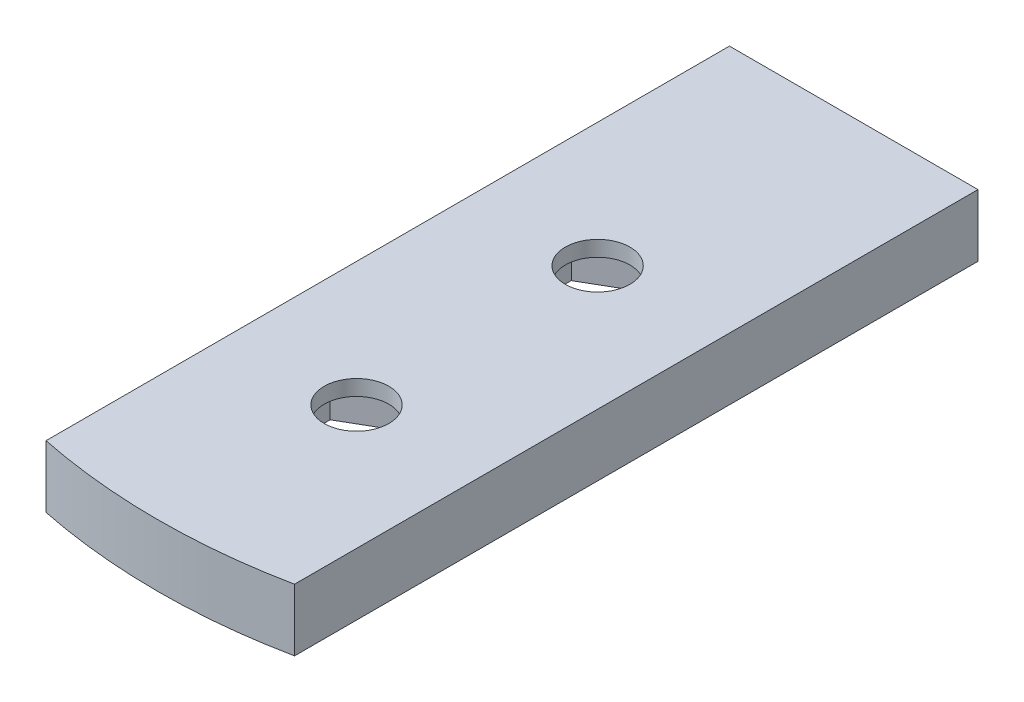
ISO-10303-21;
HEADER;
FILE_DESCRIPTION(('STEP AP214'),'2;1');
FILE_NAME('part.step','',(''),(''),'','','');
FILE_SCHEMA(('AUTOMOTIVE_DESIGN { 1 0 10303 214 1 1 1 1 }'));
ENDSEC;
DATA;
#1=APPLICATION_CONTEXT('core data for automotive mechanical design processes');
#2=APPLICATION_PROTOCOL_DEFINITION('international standard','automotive_design',2000,#1);
#3=PRODUCT_CONTEXT('',#1,'mechanical');
#4=PRODUCT('Part','Part','',(#3));
#5=PRODUCT_RELATED_PRODUCT_CATEGORY('part','',(#4));
#6=PRODUCT_DEFINITION_FORMATION('','',#4);
#7=PRODUCT_DEFINITION_CONTEXT('part definition',#1,'design');
#8=PRODUCT_DEFINITION('design','',#6,#7);
#9=PRODUCT_DEFINITION_SHAPE('','',#8);
#10=(LENGTH_UNIT() NAMED_UNIT(*) SI_UNIT(.MILLI.,.METRE.));
#11=(NAMED_UNIT(*) PLANE_ANGLE_UNIT() SI_UNIT($,.RADIAN.));
#12=(NAMED_UNIT(*) SI_UNIT($,.STERADIAN.) SOLID_ANGLE_UNIT());
#13=UNCERTAINTY_MEASURE_WITH_UNIT(LENGTH_MEASURE(1.E-05),#10,'distance_accuracy_value','');
#14=(GEOMETRIC_REPRESENTATION_CONTEXT(3) GLOBAL_UNCERTAINTY_ASSIGNED_CONTEXT((#13)) GLOBAL_UNIT_ASSIGNED_CONTEXT((#10,
#11,#12)) REPRESENTATION_CONTEXT('',''));
#15=CARTESIAN_POINT('',(0.,0.,0.));
#16=DIRECTION('',(0.,0.,1.));
#17=DIRECTION('',(1.,0.,0.));
#18=AXIS2_PLACEMENT_3D('',#15,#16,#17);
#19=CARTESIAN_POINT('',(-0.00583710172408214,0.,13.9437641846587));
#20=DIRECTION('',(0.,1.,0.));
#21=DIRECTION('',(0.,0.,1.));
#22=AXIS2_PLACEMENT_3D('',#19,#20,#21);
#23=PLANE('',#22);
#24=DIRECTION('',(0.866025403784438,0.,-0.5));
#25=VECTOR('',#24,1.);
#26=CARTESIAN_POINT('',(-0.00583710172408144,0.,26.8956030908503));
#27=LINE('',#26,#25);
#28=CARTESIAN_POINT('',(-0.00583710172408127,0.,26.8956030908503));
#29=VERTEX_POINT('',#28);
#30=CARTESIAN_POINT('',(3.18186289827592,0.,25.0551836377545));
#31=VERTEX_POINT('',#30);
#32=EDGE_CURVE('E56',#29,#31,#27,.T.);
#33=ORIENTED_EDGE('',*,*,#32,.T.);
#34=DIRECTION('',(0.,0.,-1.));
#35=VECTOR('',#34,1.);
#36=CARTESIAN_POINT('',(3.18186289827592,0.,25.0551836377545));
#37=LINE('',#36,#35);
#38=CARTESIAN_POINT('',(3.18186289827592,0.,21.3743447315629));
#39=VERTEX_POINT('',#38);
#40=EDGE_CURVE('E248',#31,#39,#37,.T.);
#41=ORIENTED_EDGE('',*,*,#40,.T.);
#42=DIRECTION('',(-0.866025403784438,0.,-0.500000000000001));
#43=VECTOR('',#42,1.);
#44=CARTESIAN_POINT('',(3.18186289827592,0.,21.3743447315629));
#45=LINE('',#44,#43);
#46=CARTESIAN_POINT('',(-0.00583710172407792,0.,19.5339252784672));
#47=VERTEX_POINT('',#46);
#48=EDGE_CURVE('E251',#39,#47,#45,.T.);
#49=ORIENTED_EDGE('',*,*,#48,.T.);
#50=DIRECTION('',(-0.866025403784438,0.,0.5));
#51=VECTOR('',#50,1.);
#52=CARTESIAN_POINT('',(-0.00583710172407792,0.,19.5339252784672));
#53=LINE('',#52,#51);
#54=CARTESIAN_POINT('',(-3.19353710172408,0.,21.3743447315629));
#55=VERTEX_POINT('',#54);
#56=EDGE_CURVE('E254',#47,#55,#53,.T.);
#57=ORIENTED_EDGE('',*,*,#56,.T.);
#58=DIRECTION('',(0.,0.,1.));
#59=VECTOR('',#58,1.);
#60=CARTESIAN_POINT('',(-3.19353710172408,0.,21.3743447315629));
#61=LINE('',#60,#59);
#62=CARTESIAN_POINT('',(-3.19353710172408,0.,25.0551836377545));
#63=VERTEX_POINT('',#62);
#64=EDGE_CURVE('E257',#55,#63,#61,.T.);
#65=ORIENTED_EDGE('',*,*,#64,.T.);
#66=DIRECTION('',(0.866025403784438,0.,0.5));
#67=VECTOR('',#66,1.);
#68=CARTESIAN_POINT('',(-3.19353710172408,0.,25.0551836377545));
#69=LINE('',#68,#67);
#70=EDGE_CURVE('E231',#63,#29,#69,.T.);
#71=ORIENTED_EDGE('',*,*,#70,.T.);
#72=EDGE_LOOP('',(#33,#41,#49,#57,#65,#71));
#73=FACE_BOUND('',#72,.T.);
#74=DIRECTION('',(0.,0.,1.));
#75=VECTOR('',#74,1.);
#76=CARTESIAN_POINT('',(-6.35583710172408,0.,10.1272839180051));
#77=LINE('',#76,#75);
#78=CARTESIAN_POINT('',(-6.35583710172408,0.,10.1272839180051));
#79=VERTEX_POINT('',#78);
#80=CARTESIAN_POINT('',(-6.35583710172409,0.,45.0522839180051));
#81=VERTEX_POINT('',#80);
#82=EDGE_CURVE('E273',#79,#81,#77,.T.);
#83=ORIENTED_EDGE('',*,*,#82,.F.);
#84=DIRECTION('',(-1.,0.,0.));
#85=VECTOR('',#84,1.);
#86=CARTESIAN_POINT('',(-6.35583710172408,0.,10.1272839180051));
#87=LINE('',#86,#85);
#88=CARTESIAN_POINT('',(6.34416289827592,0.,10.1272839180051));
#89=VERTEX_POINT('',#88);
#90=EDGE_CURVE('E279',#89,#79,#87,.T.);
#91=ORIENTED_EDGE('',*,*,#90,.F.);
#92=DIRECTION('',(0.,0.,-1.));
#93=VECTOR('',#92,1.);
#94=CARTESIAN_POINT('',(6.34416289827592,0.,10.1272839180051));
#95=LINE('',#94,#93);
#96=CARTESIAN_POINT('',(6.34416289827592,0.,45.0522839180051));
#97=VERTEX_POINT('',#96);
#98=EDGE_CURVE('E277',#97,#89,#95,.T.);
#99=ORIENTED_EDGE('',*,*,#98,.F.);
#100=CARTESIAN_POINT('',(-0.00583710172408214,0.,13.9437641846587));
#101=DIRECTION('',(0.,1.,0.));
#102=DIRECTION('',(0.,0.,1.));
#103=AXIS2_PLACEMENT_3D('',#100,#101,#102);
#104=CIRCLE('',#103,31.75);
#105=EDGE_CURVE('E154',#81,#97,#104,.T.);
#106=ORIENTED_EDGE('',*,*,#105,.F.);
#107=EDGE_LOOP('',(#83,#91,#99,#106));
#108=FACE_BOUND('',#107,.T.);
#109=DIRECTION('',(0.866025403784439,0.,-0.499999999999999));
#110=VECTOR('',#109,1.);
#111=CARTESIAN_POINT('',(-0.00583710172407687,0.,39.2146030908503));
#112=LINE('',#111,#110);
#113=CARTESIAN_POINT('',(-0.00583710172407693,0.,39.2146030908503));
#114=VERTEX_POINT('',#113);
#115=CARTESIAN_POINT('',(3.18186289827592,0.,37.3741836377545));
#116=VERTEX_POINT('',#115);
#117=EDGE_CURVE('E48',#114,#116,#112,.T.);
#118=ORIENTED_EDGE('',*,*,#117,.T.);
#119=DIRECTION('',(0.,0.,-1.));
#120=VECTOR('',#119,1.);
#121=CARTESIAN_POINT('',(3.18186289827592,0.,37.3741836377545));
#122=LINE('',#121,#120);
#123=CARTESIAN_POINT('',(3.18186289827592,0.,33.6933447315629));
#124=VERTEX_POINT('',#123);
#125=EDGE_CURVE('E202',#116,#124,#122,.T.);
#126=ORIENTED_EDGE('',*,*,#125,.T.);
#127=DIRECTION('',(-0.866025403784439,0.,-0.5));
#128=VECTOR('',#127,1.);
#129=CARTESIAN_POINT('',(3.18186289827592,0.,33.6933447315629));
#130=LINE('',#129,#128);
#131=CARTESIAN_POINT('',(-0.00583710172408358,0.,31.8529252784672));
#132=VERTEX_POINT('',#131);
#133=EDGE_CURVE('E205',#124,#132,#130,.T.);
#134=ORIENTED_EDGE('',*,*,#133,.T.);
#135=DIRECTION('',(-0.866025403784439,0.,0.499999999999999));
#136=VECTOR('',#135,1.);
#137=CARTESIAN_POINT('',(-0.00583710172408358,0.,31.8529252784672));
#138=LINE('',#137,#136);
#139=CARTESIAN_POINT('',(-3.19353710172409,0.,33.6933447315629));
#140=VERTEX_POINT('',#139);
#141=EDGE_CURVE('E208',#132,#140,#138,.T.);
#142=ORIENTED_EDGE('',*,*,#141,.T.);
#143=DIRECTION('',(0.,0.,1.));
#144=VECTOR('',#143,1.);
#145=CARTESIAN_POINT('',(-3.19353710172409,0.,33.6933447315629));
#146=LINE('',#145,#144);
#147=CARTESIAN_POINT('',(-3.19353710172409,0.,37.3741836377545));
#148=VERTEX_POINT('',#147);
#149=EDGE_CURVE('E211',#140,#148,#146,.T.);
#150=ORIENTED_EDGE('',*,*,#149,.T.);
#151=DIRECTION('',(0.866025403784439,0.,0.499999999999999));
#152=VECTOR('',#151,1.);
#153=CARTESIAN_POINT('',(-3.19353710172409,0.,37.3741836377545));
#154=LINE('',#153,#152);
#155=EDGE_CURVE('E185',#148,#114,#154,.T.);
#156=ORIENTED_EDGE('',*,*,#155,.T.);
#157=EDGE_LOOP('',(#118,#126,#134,#142,#150,#156));
#158=FACE_BOUND('',#157,.T.);
#159=ADVANCED_FACE('F33',(#73,#108,#158),#23,.F.);
#160=CARTESIAN_POINT('',(-6.35583710172408,2.38125,10.1272839180051));
#161=DIRECTION('',(1.,0.,0.));
#162=DIRECTION('',(0.,0.,-1.));
#163=AXIS2_PLACEMENT_3D('',#160,#161,#162);
#164=PLANE('',#163);
#165=ORIENTED_EDGE('',*,*,#82,.T.);
#166=DIRECTION('',(0.,-1.,0.));
#167=VECTOR('',#166,1.);
#168=CARTESIAN_POINT('',(-6.35583710172409,2.38125,45.0522839180051));
#169=LINE('',#168,#167);
#170=CARTESIAN_POINT('',(-6.35583710172409,3.175,45.0522839180051));
#171=VERTEX_POINT('',#170);
#172=EDGE_CURVE('E11',#171,#81,#169,.T.);
#173=ORIENTED_EDGE('',*,*,#172,.F.);
#174=DIRECTION('',(0.,0.,1.));
#175=VECTOR('',#174,1.);
#176=CARTESIAN_POINT('',(-6.35583710172408,3.175,10.1272839180051));
#177=LINE('',#176,#175);
#178=CARTESIAN_POINT('',(-6.35583710172408,3.175,10.1272839180051));
#179=VERTEX_POINT('',#178);
#180=EDGE_CURVE('E171',#179,#171,#177,.T.);
#181=ORIENTED_EDGE('',*,*,#180,.F.);
#182=DIRECTION('',(0.,-1.,0.));
#183=VECTOR('',#182,1.);
#184=CARTESIAN_POINT('',(-6.35583710172408,2.38125,10.1272839180051));
#185=LINE('',#184,#183);
#186=EDGE_CURVE('E281',#179,#79,#185,.T.);
#187=ORIENTED_EDGE('',*,*,#186,.T.);
#188=EDGE_LOOP('',(#165,#173,#181,#187));
#189=FACE_BOUND('',#188,.T.);
#190=ADVANCED_FACE('F35',(#189),#164,.F.);
#191=CARTESIAN_POINT('',(-0.00583710172408214,2.38125,13.9437641846587));
#192=DIRECTION('',(0.,-1.,0.));
#193=DIRECTION('',(0.,0.,-1.));
#194=AXIS2_PLACEMENT_3D('',#191,#192,#193);
#195=CYLINDRICAL_SURFACE('',#194,31.75);
#196=ORIENTED_EDGE('',*,*,#105,.T.);
#197=DIRECTION('',(0.,-1.,0.));
#198=VECTOR('',#197,1.);
#199=CARTESIAN_POINT('',(6.34416289827592,2.38125,45.0522839180051));
#200=LINE('',#199,#198);
#201=CARTESIAN_POINT('',(6.34416289827592,3.175,45.0522839180051));
#202=VERTEX_POINT('',#201);
#203=EDGE_CURVE('E41',#202,#97,#200,.T.);
#204=ORIENTED_EDGE('',*,*,#203,.F.);
#205=CARTESIAN_POINT('',(-0.00583710172408214,3.175,13.9437641846587));
#206=DIRECTION('',(0.,1.,0.));
#207=DIRECTION('',(0.,0.,1.));
#208=AXIS2_PLACEMENT_3D('',#205,#206,#207);
#209=CIRCLE('',#208,31.75);
#210=EDGE_CURVE('E153',#171,#202,#209,.T.);
#211=ORIENTED_EDGE('',*,*,#210,.F.);
#212=ORIENTED_EDGE('',*,*,#172,.T.);
#213=EDGE_LOOP('',(#196,#204,#211,#212));
#214=FACE_BOUND('',#213,.T.);
#215=ADVANCED_FACE('F151',(#214),#195,.T.);
#216=CARTESIAN_POINT('',(6.34416289827592,2.38125,10.1272839180051));
#217=DIRECTION('',(-1.,0.,0.));
#218=DIRECTION('',(0.,0.,1.));
#219=AXIS2_PLACEMENT_3D('',#216,#217,#218);
#220=PLANE('',#219);
#221=ORIENTED_EDGE('',*,*,#98,.T.);
#222=DIRECTION('',(0.,-1.,0.));
#223=VECTOR('',#222,1.);
#224=CARTESIAN_POINT('',(6.34416289827592,2.38125,10.1272839180051));
#225=LINE('',#224,#223);
#226=CARTESIAN_POINT('',(6.34416289827592,3.175,10.1272839180051));
#227=VERTEX_POINT('',#226);
#228=EDGE_CURVE('E157',#227,#89,#225,.T.);
#229=ORIENTED_EDGE('',*,*,#228,.F.);
#230=DIRECTION('',(0.,0.,-1.));
#231=VECTOR('',#230,1.);
#232=CARTESIAN_POINT('',(6.34416289827592,3.175,45.0522839180051));
#233=LINE('',#232,#231);
#234=EDGE_CURVE('E159',#202,#227,#233,.T.);
#235=ORIENTED_EDGE('',*,*,#234,.F.);
#236=ORIENTED_EDGE('',*,*,#203,.T.);
#237=EDGE_LOOP('',(#221,#229,#235,#236));
#238=FACE_BOUND('',#237,.T.);
#239=ADVANCED_FACE('F160',(#238),#220,.F.);
#240=CARTESIAN_POINT('',(-6.35583710172408,2.38125,10.1272839180051));
#241=DIRECTION('',(0.,0.,1.));
#242=DIRECTION('',(1.,0.,0.));
#243=AXIS2_PLACEMENT_3D('',#240,#241,#242);
#244=PLANE('',#243);
#245=ORIENTED_EDGE('',*,*,#90,.T.);
#246=ORIENTED_EDGE('',*,*,#186,.F.);
#247=DIRECTION('',(-1.,0.,0.));
#248=VECTOR('',#247,1.);
#249=CARTESIAN_POINT('',(6.34416289827592,3.175,10.1272839180051));
#250=LINE('',#249,#248);
#251=EDGE_CURVE('E165',#227,#179,#250,.T.);
#252=ORIENTED_EDGE('',*,*,#251,.F.);
#253=ORIENTED_EDGE('',*,*,#228,.T.);
#254=EDGE_LOOP('',(#245,#246,#252,#253));
#255=FACE_BOUND('',#254,.T.);
#256=ADVANCED_FACE('F286',(#255),#244,.F.);
#257=CARTESIAN_POINT('',(-0.00583710172408144,2.38125,26.8956030908503));
#258=DIRECTION('',(-0.5,0.,-0.866025403784438));
#259=DIRECTION('',(-0.866025403784438,0.,0.5));
#260=AXIS2_PLACEMENT_3D('',#257,#258,#259);
#261=PLANE('',#260);
#262=ORIENTED_EDGE('',*,*,#32,.F.);
#263=DIRECTION('',(0.,-1.,0.));
#264=VECTOR('',#263,1.);
#265=CARTESIAN_POINT('',(-0.00583710172408144,2.38125,26.8956030908503));
#266=LINE('',#265,#264);
#267=CARTESIAN_POINT('',(-0.00583710172408144,2.38125,26.8956030908503));
#268=VERTEX_POINT('',#267);
#269=EDGE_CURVE('E246',#268,#29,#266,.T.);
#270=ORIENTED_EDGE('',*,*,#269,.F.);
#271=DIRECTION('',(0.866025403784438,0.,-0.5));
#272=VECTOR('',#271,1.);
#273=CARTESIAN_POINT('',(-0.00583710172408144,2.38125,26.8956030908503));
#274=LINE('',#273,#272);
#275=CARTESIAN_POINT('',(3.18186289827592,2.38125,25.0551836377545));
#276=VERTEX_POINT('',#275);
#277=EDGE_CURVE('E227',#268,#276,#274,.T.);
#278=ORIENTED_EDGE('',*,*,#277,.T.);
#279=DIRECTION('',(0.,-1.,0.));
#280=VECTOR('',#279,1.);
#281=CARTESIAN_POINT('',(3.18186289827592,2.38125,25.0551836377545));
#282=LINE('',#281,#280);
#283=EDGE_CURVE('E271',#276,#31,#282,.T.);
#284=ORIENTED_EDGE('',*,*,#283,.T.);
#285=EDGE_LOOP('',(#262,#270,#278,#284));
#286=FACE_BOUND('',#285,.T.);
#287=ADVANCED_FACE('F302',(#286),#261,.T.);
#288=CARTESIAN_POINT('',(3.18186289827592,2.38125,25.0551836377545));
#289=DIRECTION('',(-1.,0.,0.));
#290=DIRECTION('',(0.,0.,1.));
#291=AXIS2_PLACEMENT_3D('',#288,#289,#290);
#292=PLANE('',#291);
#293=ORIENTED_EDGE('',*,*,#40,.F.);
#294=ORIENTED_EDGE('',*,*,#283,.F.);
#295=DIRECTION('',(0.,0.,-1.));
#296=VECTOR('',#295,1.);
#297=CARTESIAN_POINT('',(3.18186289827592,2.38125,25.0551836377545));
#298=LINE('',#297,#296);
#299=CARTESIAN_POINT('',(3.18186289827592,2.38125,21.3743447315629));
#300=VERTEX_POINT('',#299);
#301=EDGE_CURVE('E230',#276,#300,#298,.T.);
#302=ORIENTED_EDGE('',*,*,#301,.T.);
#303=DIRECTION('',(0.,-1.,0.));
#304=VECTOR('',#303,1.);
#305=CARTESIAN_POINT('',(3.18186289827592,2.38125,21.3743447315629));
#306=LINE('',#305,#304);
#307=EDGE_CURVE('E269',#300,#39,#306,.T.);
#308=ORIENTED_EDGE('',*,*,#307,.T.);
#309=EDGE_LOOP('',(#293,#294,#302,#308));
#310=FACE_BOUND('',#309,.T.);
#311=ADVANCED_FACE('F321',(#310),#292,.T.);
#312=CARTESIAN_POINT('',(3.18186289827592,2.38125,21.3743447315629));
#313=DIRECTION('',(-0.500000000000001,0.,0.866025403784438));
#314=DIRECTION('',(0.866025403784438,0.,0.500000000000001));
#315=AXIS2_PLACEMENT_3D('',#312,#313,#314);
#316=PLANE('',#315);
#317=ORIENTED_EDGE('',*,*,#48,.F.);
#318=ORIENTED_EDGE('',*,*,#307,.F.);
#319=DIRECTION('',(-0.866025403784438,0.,-0.500000000000001));
#320=VECTOR('',#319,1.);
#321=CARTESIAN_POINT('',(3.18186289827592,2.38125,21.3743447315629));
#322=LINE('',#321,#320);
#323=CARTESIAN_POINT('',(-0.00583710172407792,2.38125,19.5339252784672));
#324=VERTEX_POINT('',#323);
#325=EDGE_CURVE('E234',#300,#324,#322,.T.);
#326=ORIENTED_EDGE('',*,*,#325,.T.);
#327=DIRECTION('',(0.,-1.,0.));
#328=VECTOR('',#327,1.);
#329=CARTESIAN_POINT('',(-0.00583710172407792,2.38125,19.5339252784672));
#330=LINE('',#329,#328);
#331=EDGE_CURVE('E267',#324,#47,#330,.T.);
#332=ORIENTED_EDGE('',*,*,#331,.T.);
#333=EDGE_LOOP('',(#317,#318,#326,#332));
#334=FACE_BOUND('',#333,.T.);
#335=ADVANCED_FACE('F327',(#334),#316,.T.);
#336=CARTESIAN_POINT('',(-0.00583710172407792,2.38125,19.5339252784672));
#337=DIRECTION('',(0.5,0.,0.866025403784438));
#338=DIRECTION('',(0.866025403784438,0.,-0.5));
#339=AXIS2_PLACEMENT_3D('',#336,#337,#338);
#340=PLANE('',#339);
#341=ORIENTED_EDGE('',*,*,#56,.F.);
#342=ORIENTED_EDGE('',*,*,#331,.F.);
#343=DIRECTION('',(-0.866025403784438,0.,0.5));
#344=VECTOR('',#343,1.);
#345=CARTESIAN_POINT('',(-0.00583710172407792,2.38125,19.5339252784672));
#346=LINE('',#345,#344);
#347=CARTESIAN_POINT('',(-3.19353710172408,2.38125,21.3743447315629));
#348=VERTEX_POINT('',#347);
#349=EDGE_CURVE('E237',#324,#348,#346,.T.);
#350=ORIENTED_EDGE('',*,*,#349,.T.);
#351=DIRECTION('',(0.,-1.,0.));
#352=VECTOR('',#351,1.);
#353=CARTESIAN_POINT('',(-3.19353710172408,2.38125,21.3743447315629));
#354=LINE('',#353,#352);
#355=EDGE_CURVE('E265',#348,#55,#354,.T.);
#356=ORIENTED_EDGE('',*,*,#355,.T.);
#357=EDGE_LOOP('',(#341,#342,#350,#356));
#358=FACE_BOUND('',#357,.T.);
#359=ADVANCED_FACE('F334',(#358),#340,.T.);
#360=CARTESIAN_POINT('',(-3.19353710172408,2.38125,21.3743447315629));
#361=DIRECTION('',(1.,0.,0.));
#362=DIRECTION('',(0.,0.,-1.));
#363=AXIS2_PLACEMENT_3D('',#360,#361,#362);
#364=PLANE('',#363);
#365=ORIENTED_EDGE('',*,*,#64,.F.);
#366=ORIENTED_EDGE('',*,*,#355,.F.);
#367=DIRECTION('',(0.,0.,1.));
#368=VECTOR('',#367,1.);
#369=CARTESIAN_POINT('',(-3.19353710172408,2.38125,21.3743447315629));
#370=LINE('',#369,#368);
#371=CARTESIAN_POINT('',(-3.19353710172408,2.38125,25.0551836377545));
#372=VERTEX_POINT('',#371);
#373=EDGE_CURVE('E240',#348,#372,#370,.T.);
#374=ORIENTED_EDGE('',*,*,#373,.T.);
#375=DIRECTION('',(0.,-1.,0.));
#376=VECTOR('',#375,1.);
#377=CARTESIAN_POINT('',(-3.19353710172408,2.38125,25.0551836377545));
#378=LINE('',#377,#376);
#379=EDGE_CURVE('E263',#372,#63,#378,.T.);
#380=ORIENTED_EDGE('',*,*,#379,.T.);
#381=EDGE_LOOP('',(#365,#366,#374,#380));
#382=FACE_BOUND('',#381,.T.);
#383=ADVANCED_FACE('F342',(#382),#364,.T.);
#384=CARTESIAN_POINT('',(-3.19353710172408,2.38125,25.0551836377545));
#385=DIRECTION('',(0.5,0.,-0.866025403784439));
#386=DIRECTION('',(-0.866025403784439,0.,-0.5));
#387=AXIS2_PLACEMENT_3D('',#384,#385,#386);
#388=PLANE('',#387);
#389=ORIENTED_EDGE('',*,*,#70,.F.);
#390=ORIENTED_EDGE('',*,*,#379,.F.);
#391=DIRECTION('',(0.866025403784438,0.,0.5));
#392=VECTOR('',#391,1.);
#393=CARTESIAN_POINT('',(-3.19353710172408,2.38125,25.0551836377545));
#394=LINE('',#393,#392);
#395=EDGE_CURVE('E243',#372,#268,#394,.T.);
#396=ORIENTED_EDGE('',*,*,#395,.T.);
#397=ORIENTED_EDGE('',*,*,#269,.T.);
#398=EDGE_LOOP('',(#389,#390,#396,#397));
#399=FACE_BOUND('',#398,.T.);
#400=ADVANCED_FACE('F350',(#399),#388,.T.);
#401=CARTESIAN_POINT('',(-0.00583710172407687,2.38125,39.2146030908503));
#402=DIRECTION('',(-0.499999999999999,0.,-0.866025403784439));
#403=DIRECTION('',(-0.866025403784439,0.,0.499999999999999));
#404=AXIS2_PLACEMENT_3D('',#401,#402,#403);
#405=PLANE('',#404);
#406=ORIENTED_EDGE('',*,*,#117,.F.);
#407=DIRECTION('',(0.,-1.,0.));
#408=VECTOR('',#407,1.);
#409=CARTESIAN_POINT('',(-0.00583710172407687,2.38125,39.2146030908503));
#410=LINE('',#409,#408);
#411=CARTESIAN_POINT('',(-0.00583710172407687,2.38125,39.2146030908503));
#412=VERTEX_POINT('',#411);
#413=EDGE_CURVE('E200',#412,#114,#410,.T.);
#414=ORIENTED_EDGE('',*,*,#413,.F.);
#415=DIRECTION('',(0.866025403784439,0.,-0.499999999999999));
#416=VECTOR('',#415,1.);
#417=CARTESIAN_POINT('',(-0.00583710172407687,2.38125,39.2146030908503));
#418=LINE('',#417,#416);
#419=CARTESIAN_POINT('',(3.18186289827592,2.38125,37.3741836377545));
#420=VERTEX_POINT('',#419);
#421=EDGE_CURVE('E181',#412,#420,#418,.T.);
#422=ORIENTED_EDGE('',*,*,#421,.T.);
#423=DIRECTION('',(0.,-1.,0.));
#424=VECTOR('',#423,1.);
#425=CARTESIAN_POINT('',(3.18186289827592,2.38125,37.3741836377545));
#426=LINE('',#425,#424);
#427=EDGE_CURVE('E225',#420,#116,#426,.T.);
#428=ORIENTED_EDGE('',*,*,#427,.T.);
#429=EDGE_LOOP('',(#406,#414,#422,#428));
#430=FACE_BOUND('',#429,.T.);
#431=ADVANCED_FACE('F358',(#430),#405,.T.);
#432=CARTESIAN_POINT('',(3.18186289827592,2.38125,37.3741836377545));
#433=DIRECTION('',(-1.,0.,0.));
#434=DIRECTION('',(0.,0.,1.));
#435=AXIS2_PLACEMENT_3D('',#432,#433,#434);
#436=PLANE('',#435);
#437=ORIENTED_EDGE('',*,*,#125,.F.);
#438=ORIENTED_EDGE('',*,*,#427,.F.);
#439=DIRECTION('',(0.,0.,-1.));
#440=VECTOR('',#439,1.);
#441=CARTESIAN_POINT('',(3.18186289827592,2.38125,37.3741836377545));
#442=LINE('',#441,#440);
#443=CARTESIAN_POINT('',(3.18186289827592,2.38125,33.6933447315629));
#444=VERTEX_POINT('',#443);
#445=EDGE_CURVE('E184',#420,#444,#442,.T.);
#446=ORIENTED_EDGE('',*,*,#445,.T.);
#447=DIRECTION('',(0.,-1.,0.));
#448=VECTOR('',#447,1.);
#449=CARTESIAN_POINT('',(3.18186289827592,2.38125,33.6933447315629));
#450=LINE('',#449,#448);
#451=EDGE_CURVE('E223',#444,#124,#450,.T.);
#452=ORIENTED_EDGE('',*,*,#451,.T.);
#453=EDGE_LOOP('',(#437,#438,#446,#452));
#454=FACE_BOUND('',#453,.T.);
#455=ADVANCED_FACE('F366',(#454),#436,.T.);
#456=CARTESIAN_POINT('',(3.18186289827592,2.38125,33.6933447315629));
#457=DIRECTION('',(-0.5,0.,0.866025403784439));
#458=DIRECTION('',(0.866025403784439,0.,0.5));
#459=AXIS2_PLACEMENT_3D('',#456,#457,#458);
#460=PLANE('',#459);
#461=ORIENTED_EDGE('',*,*,#133,.F.);
#462=ORIENTED_EDGE('',*,*,#451,.F.);
#463=DIRECTION('',(-0.866025403784439,0.,-0.5));
#464=VECTOR('',#463,1.);
#465=CARTESIAN_POINT('',(3.18186289827592,2.38125,33.6933447315629));
#466=LINE('',#465,#464);
#467=CARTESIAN_POINT('',(-0.00583710172408358,2.38125,31.8529252784672));
#468=VERTEX_POINT('',#467);
#469=EDGE_CURVE('E188',#444,#468,#466,.T.);
#470=ORIENTED_EDGE('',*,*,#469,.T.);
#471=DIRECTION('',(0.,-1.,0.));
#472=VECTOR('',#471,1.);
#473=CARTESIAN_POINT('',(-0.00583710172408358,2.38125,31.8529252784672));
#474=LINE('',#473,#472);
#475=EDGE_CURVE('E221',#468,#132,#474,.T.);
#476=ORIENTED_EDGE('',*,*,#475,.T.);
#477=EDGE_LOOP('',(#461,#462,#470,#476));
#478=FACE_BOUND('',#477,.T.);
#479=ADVANCED_FACE('F373',(#478),#460,.T.);
#480=CARTESIAN_POINT('',(-0.00583710172408358,2.38125,31.8529252784672));
#481=DIRECTION('',(0.499999999999999,0.,0.866025403784439));
#482=DIRECTION('',(0.866025403784439,0.,-0.499999999999999));
#483=AXIS2_PLACEMENT_3D('',#480,#481,#482);
#484=PLANE('',#483);
#485=ORIENTED_EDGE('',*,*,#141,.F.);
#486=ORIENTED_EDGE('',*,*,#475,.F.);
#487=DIRECTION('',(-0.866025403784439,0.,0.499999999999999));
#488=VECTOR('',#487,1.);
#489=CARTESIAN_POINT('',(-0.00583710172408358,2.38125,31.8529252784672));
#490=LINE('',#489,#488);
#491=CARTESIAN_POINT('',(-3.19353710172409,2.38125,33.6933447315629));
#492=VERTEX_POINT('',#491);
#493=EDGE_CURVE('E191',#468,#492,#490,.T.);
#494=ORIENTED_EDGE('',*,*,#493,.T.);
#495=DIRECTION('',(0.,-1.,0.));
#496=VECTOR('',#495,1.);
#497=CARTESIAN_POINT('',(-3.19353710172409,2.38125,33.6933447315629));
#498=LINE('',#497,#496);
#499=EDGE_CURVE('E219',#492,#140,#498,.T.);
#500=ORIENTED_EDGE('',*,*,#499,.T.);
#501=EDGE_LOOP('',(#485,#486,#494,#500));
#502=FACE_BOUND('',#501,.T.);
#503=ADVANCED_FACE('F381',(#502),#484,.T.);
#504=CARTESIAN_POINT('',(-3.19353710172409,2.38125,33.6933447315629));
#505=DIRECTION('',(1.,0.,0.));
#506=DIRECTION('',(0.,0.,-1.));
#507=AXIS2_PLACEMENT_3D('',#504,#505,#506);
#508=PLANE('',#507);
#509=ORIENTED_EDGE('',*,*,#149,.F.);
#510=ORIENTED_EDGE('',*,*,#499,.F.);
#511=DIRECTION('',(0.,0.,1.));
#512=VECTOR('',#511,1.);
#513=CARTESIAN_POINT('',(-3.19353710172409,2.38125,33.6933447315629));
#514=LINE('',#513,#512);
#515=CARTESIAN_POINT('',(-3.19353710172409,2.38125,37.3741836377545));
#516=VERTEX_POINT('',#515);
#517=EDGE_CURVE('E194',#492,#516,#514,.T.);
#518=ORIENTED_EDGE('',*,*,#517,.T.);
#519=DIRECTION('',(0.,-1.,0.));
#520=VECTOR('',#519,1.);
#521=CARTESIAN_POINT('',(-3.19353710172409,2.38125,37.3741836377545));
#522=LINE('',#521,#520);
#523=EDGE_CURVE('E217',#516,#148,#522,.T.);
#524=ORIENTED_EDGE('',*,*,#523,.T.);
#525=EDGE_LOOP('',(#509,#510,#518,#524));
#526=FACE_BOUND('',#525,.T.);
#527=ADVANCED_FACE('F389',(#526),#508,.T.);
#528=CARTESIAN_POINT('',(-3.19353710172409,2.38125,37.3741836377545));
#529=DIRECTION('',(0.499999999999999,0.,-0.866025403784439));
#530=DIRECTION('',(-0.866025403784439,0.,-0.499999999999999));
#531=AXIS2_PLACEMENT_3D('',#528,#529,#530);
#532=PLANE('',#531);
#533=ORIENTED_EDGE('',*,*,#155,.F.);
#534=ORIENTED_EDGE('',*,*,#523,.F.);
#535=DIRECTION('',(0.866025403784439,0.,0.499999999999999));
#536=VECTOR('',#535,1.);
#537=CARTESIAN_POINT('',(-3.19353710172409,2.38125,37.3741836377545));
#538=LINE('',#537,#536);
#539=EDGE_CURVE('E197',#516,#412,#538,.T.);
#540=ORIENTED_EDGE('',*,*,#539,.T.);
#541=ORIENTED_EDGE('',*,*,#413,.T.);
#542=EDGE_LOOP('',(#533,#534,#540,#541));
#543=FACE_BOUND('',#542,.T.);
#544=ADVANCED_FACE('F397',(#543),#532,.T.);
#545=CARTESIAN_POINT('',(-0.00583710172408214,2.38125,13.9437641846587));
#546=DIRECTION('',(0.,1.,0.));
#547=DIRECTION('',(0.,0.,1.));
#548=AXIS2_PLACEMENT_3D('',#545,#546,#547);
#549=PLANE('',#548);
#550=ORIENTED_EDGE('',*,*,#301,.F.);
#551=ORIENTED_EDGE('',*,*,#277,.F.);
#552=ORIENTED_EDGE('',*,*,#395,.F.);
#553=ORIENTED_EDGE('',*,*,#373,.F.);
#554=ORIENTED_EDGE('',*,*,#349,.F.);
#555=ORIENTED_EDGE('',*,*,#325,.F.);
#556=EDGE_LOOP('',(#550,#551,#552,#553,#554,#555));
#557=FACE_BOUND('',#556,.T.);
#558=CARTESIAN_POINT('',(-0.00583710172408214,2.38125,23.2147641846587));
#559=DIRECTION('',(0.,1.,0.));
#560=DIRECTION('',(0.,0.,1.));
#561=AXIS2_PLACEMENT_3D('',#558,#559,#560);
#562=CIRCLE('',#561,1.65100000000002);
#563=CARTESIAN_POINT('',(-0.00583710172408214,2.38125,24.8657641846587));
#564=VERTEX_POINT('',#563);
#565=EDGE_CURVE('E175',#564,#564,#562,.T.);
#566=ORIENTED_EDGE('',*,*,#565,.T.);
#567=EDGE_LOOP('',(#566));
#568=FACE_BOUND('',#567,.T.);
#569=ADVANCED_FACE('F405',(#557,#568),#549,.F.);
#570=CARTESIAN_POINT('',(-0.00583710172408214,3.175,13.9437641846587));
#571=DIRECTION('',(0.,1.,0.));
#572=DIRECTION('',(0.,0.,1.));
#573=AXIS2_PLACEMENT_3D('',#570,#571,#572);
#574=PLANE('',#573);
#575=CARTESIAN_POINT('',(-0.00583710172408214,3.175,23.2147641846587));
#576=DIRECTION('',(0.,1.,0.));
#577=DIRECTION('',(0.,0.,1.));
#578=AXIS2_PLACEMENT_3D('',#575,#576,#577);
#579=CIRCLE('',#578,1.65100000000002);
#580=CARTESIAN_POINT('',(-0.00583710172408214,3.175,24.8657641846587));
#581=VERTEX_POINT('',#580);
#582=EDGE_CURVE('E172',#581,#581,#579,.T.);
#583=ORIENTED_EDGE('',*,*,#582,.F.);
#584=EDGE_LOOP('',(#583));
#585=FACE_BOUND('',#584,.T.);
#586=ORIENTED_EDGE('',*,*,#210,.T.);
#587=ORIENTED_EDGE('',*,*,#234,.T.);
#588=ORIENTED_EDGE('',*,*,#251,.T.);
#589=ORIENTED_EDGE('',*,*,#180,.T.);
#590=EDGE_LOOP('',(#586,#587,#588,#589));
#591=FACE_BOUND('',#590,.T.);
#592=CARTESIAN_POINT('',(-0.00583710172408214,3.175,35.5337641846587));
#593=DIRECTION('',(0.,1.,0.));
#594=DIRECTION('',(0.,0.,1.));
#595=AXIS2_PLACEMENT_3D('',#592,#593,#594);
#596=CIRCLE('',#595,1.65100000000001);
#597=CARTESIAN_POINT('',(-0.00583710172408214,3.175,37.1847641846587));
#598=VERTEX_POINT('',#597);
#599=EDGE_CURVE('E511',#598,#598,#596,.T.);
#600=ORIENTED_EDGE('',*,*,#599,.F.);
#601=EDGE_LOOP('',(#600));
#602=FACE_BOUND('',#601,.T.);
#603=ADVANCED_FACE('F168',(#585,#591,#602),#574,.T.);
#604=ORIENTED_EDGE('',*,*,#445,.F.);
#605=ORIENTED_EDGE('',*,*,#421,.F.);
#606=ORIENTED_EDGE('',*,*,#539,.F.);
#607=ORIENTED_EDGE('',*,*,#517,.F.);
#608=ORIENTED_EDGE('',*,*,#493,.F.);
#609=ORIENTED_EDGE('',*,*,#469,.F.);
#610=EDGE_LOOP('',(#604,#605,#606,#607,#608,#609));
#611=FACE_BOUND('',#610,.T.);
#612=CARTESIAN_POINT('',(-0.00583710172408214,2.38125,35.5337641846587));
#613=DIRECTION('',(0.,1.,0.));
#614=DIRECTION('',(0.,0.,1.));
#615=AXIS2_PLACEMENT_3D('',#612,#613,#614);
#616=CIRCLE('',#615,1.65100000000001);
#617=CARTESIAN_POINT('',(-0.00583710172408214,2.38125,37.1847641846587));
#618=VERTEX_POINT('',#617);
#619=EDGE_CURVE('E514',#618,#618,#616,.T.);
#620=ORIENTED_EDGE('',*,*,#619,.T.);
#621=EDGE_LOOP('',(#620));
#622=FACE_BOUND('',#621,.T.);
#623=ADVANCED_FACE('F415',(#611,#622),#549,.F.);
#624=CARTESIAN_POINT('',(-0.00583710172408214,3.175,23.2147641846587));
#625=DIRECTION('',(0.,-1.,0.));
#626=DIRECTION('',(0.,0.,-1.));
#627=AXIS2_PLACEMENT_3D('',#624,#625,#626);
#628=CYLINDRICAL_SURFACE('',#627,1.65100000000002);
#629=ORIENTED_EDGE('',*,*,#582,.T.);
#630=EDGE_LOOP('',(#629));
#631=FACE_BOUND('',#630,.T.);
#632=ORIENTED_EDGE('',*,*,#565,.F.);
#633=EDGE_LOOP('',(#632));
#634=FACE_BOUND('',#633,.T.);
#635=ADVANCED_FACE('F428',(#631,#634),#628,.F.);
#636=CARTESIAN_POINT('',(-0.00583710172408214,3.175,35.5337641846587));
#637=DIRECTION('',(0.,-1.,0.));
#638=DIRECTION('',(0.,0.,-1.));
#639=AXIS2_PLACEMENT_3D('',#636,#637,#638);
#640=CYLINDRICAL_SURFACE('',#639,1.65100000000001);
#641=ORIENTED_EDGE('',*,*,#599,.T.);
#642=EDGE_LOOP('',(#641));
#643=FACE_BOUND('',#642,.T.);
#644=ORIENTED_EDGE('',*,*,#619,.F.);
#645=EDGE_LOOP('',(#644));
#646=FACE_BOUND('',#645,.T.);
#647=ADVANCED_FACE('F435',(#643,#646),#640,.F.);
#648=CLOSED_SHELL('',(#159,#190,#215,#239,#256,#287,#311,#335,#359,#383,#400,#431,#455,#479,
#503,#527,#544,#569,#603,#623,#635,#647));
#649=MANIFOLD_SOLID_BREP('B2',#648);
#650=ADVANCED_BREP_SHAPE_REPRESENTATION('',(#18,#649),#14);
#651=SHAPE_DEFINITION_REPRESENTATION(#9,#650);
ENDSEC;
END-ISO-10303-21;
